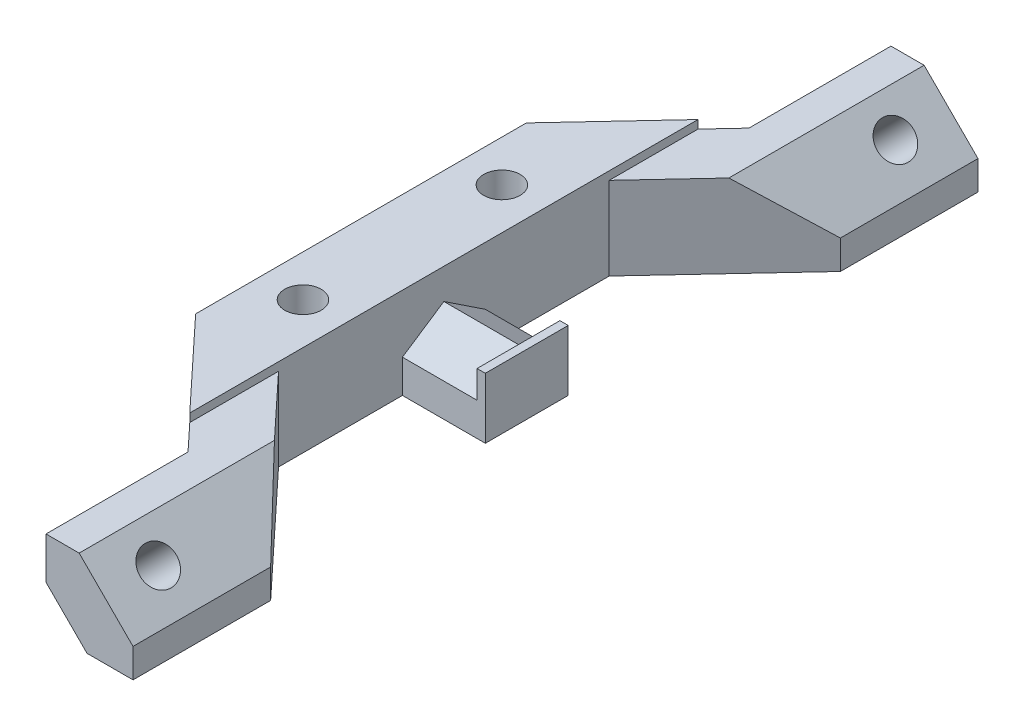
ISO-10303-21;
HEADER;
FILE_DESCRIPTION(('STEP AP214'),'2;1');
FILE_NAME('part.step','',(''),(''),'','','');
FILE_SCHEMA(('AUTOMOTIVE_DESIGN { 1 0 10303 214 1 1 1 1 }'));
ENDSEC;
DATA;
#1=APPLICATION_CONTEXT('core data for automotive mechanical design processes');
#2=APPLICATION_PROTOCOL_DEFINITION('international standard','automotive_design',2000,#1);
#3=PRODUCT_CONTEXT('',#1,'mechanical');
#4=PRODUCT('Part','Part','',(#3));
#5=PRODUCT_RELATED_PRODUCT_CATEGORY('part','',(#4));
#6=PRODUCT_DEFINITION_FORMATION('','',#4);
#7=PRODUCT_DEFINITION_CONTEXT('part definition',#1,'design');
#8=PRODUCT_DEFINITION('design','',#6,#7);
#9=PRODUCT_DEFINITION_SHAPE('','',#8);
#10=(LENGTH_UNIT() NAMED_UNIT(*) SI_UNIT(.MILLI.,.METRE.));
#11=(NAMED_UNIT(*) PLANE_ANGLE_UNIT() SI_UNIT($,.RADIAN.));
#12=(NAMED_UNIT(*) SI_UNIT($,.STERADIAN.) SOLID_ANGLE_UNIT());
#13=UNCERTAINTY_MEASURE_WITH_UNIT(LENGTH_MEASURE(1.E-05),#10,'distance_accuracy_value','');
#14=(GEOMETRIC_REPRESENTATION_CONTEXT(3) GLOBAL_UNCERTAINTY_ASSIGNED_CONTEXT((#13)) GLOBAL_UNIT_ASSIGNED_CONTEXT((#10,
#11,#12)) REPRESENTATION_CONTEXT('',''));
#15=CARTESIAN_POINT('',(0.,0.,0.));
#16=DIRECTION('',(0.,0.,1.));
#17=DIRECTION('',(1.,0.,0.));
#18=AXIS2_PLACEMENT_3D('',#15,#16,#17);
#19=CARTESIAN_POINT('',(-18.6319731957759,10.,5.35370027381823));
#20=DIRECTION('',(0.,-1.,0.));
#21=DIRECTION('',(0.,0.,-1.));
#22=AXIS2_PLACEMENT_3D('',#19,#20,#21);
#23=PLANE('',#22);
#24=DIRECTION('',(0.,0.,-1.));
#25=VECTOR('',#24,1.);
#26=CARTESIAN_POINT('',(5.,10.,30.6574005476366));
#27=LINE('',#26,#25);
#28=CARTESIAN_POINT('',(5.,10.,30.6574005476366));
#29=VERTEX_POINT('',#28);
#30=CARTESIAN_POINT('',(5.,10.,19.95));
#31=VERTEX_POINT('',#30);
#32=EDGE_CURVE('E50',#29,#31,#27,.T.);
#33=ORIENTED_EDGE('',*,*,#32,.F.);
#34=DIRECTION('',(0.682552631578946,0.,0.730836442115919));
#35=VECTOR('',#34,1.);
#36=CARTESIAN_POINT('',(-5.,10.,19.95));
#37=LINE('',#36,#35);
#38=CARTESIAN_POINT('',(7.9685,10.,33.8358924002025));
#39=VERTEX_POINT('',#38);
#40=EDGE_CURVE('E237',#29,#39,#37,.T.);
#41=ORIENTED_EDGE('',*,*,#40,.T.);
#42=DIRECTION('',(0.,0.,1.));
#43=VECTOR('',#42,1.);
#44=CARTESIAN_POINT('',(7.9685,10.,50.9712624275843));
#45=LINE('',#44,#43);
#46=CARTESIAN_POINT('',(7.9685,10.,50.9712624275843));
#47=VERTEX_POINT('',#46);
#48=EDGE_CURVE('E468',#39,#47,#45,.T.);
#49=ORIENTED_EDGE('',*,*,#48,.T.);
#50=DIRECTION('',(1.,0.,0.));
#51=VECTOR('',#50,1.);
#52=CARTESIAN_POINT('',(18.4685,10.,50.9712624275843));
#53=LINE('',#52,#51);
#54=CARTESIAN_POINT('',(11.9685,10.,50.9712624275843));
#55=VERTEX_POINT('',#54);
#56=EDGE_CURVE('E255',#47,#55,#53,.T.);
#57=ORIENTED_EDGE('',*,*,#56,.T.);
#58=DIRECTION('',(0.,0.,1.));
#59=VECTOR('',#58,1.);
#60=CARTESIAN_POINT('',(11.9685,10.,5.35370027381824));
#61=LINE('',#60,#59);
#62=CARTESIAN_POINT('',(11.9685,10.,27.4114520716205));
#63=VERTEX_POINT('',#62);
#64=EDGE_CURVE('E42',#63,#55,#61,.T.);
#65=ORIENTED_EDGE('',*,*,#64,.F.);
#66=DIRECTION('',(-0.682552631578947,0.,-0.730836442115919));
#67=VECTOR('',#66,1.);
#68=CARTESIAN_POINT('',(5.,10.,19.95));
#69=LINE('',#68,#67);
#70=EDGE_CURVE('E253',#63,#31,#69,.T.);
#71=ORIENTED_EDGE('',*,*,#70,.T.);
#72=EDGE_LOOP('',(#33,#41,#49,#57,#65,#71));
#73=FACE_BOUND('',#72,.T.);
#74=ADVANCED_FACE('F33',(#73),#23,.F.);
#75=CARTESIAN_POINT('',(5.,10.,-19.95));
#76=VERTEX_POINT('',#75);
#77=CARTESIAN_POINT('',(5.,10.,-30.6574005476366));
#78=VERTEX_POINT('',#77);
#79=EDGE_CURVE('E11',#76,#78,#27,.T.);
#80=ORIENTED_EDGE('',*,*,#79,.F.);
#81=DIRECTION('',(0.682552631578948,0.,-0.730836442115918));
#82=VECTOR('',#81,1.);
#83=CARTESIAN_POINT('',(5.,10.,-19.95));
#84=LINE('',#83,#82);
#85=CARTESIAN_POINT('',(11.9685,10.,-27.4114520716205));
#86=VERTEX_POINT('',#85);
#87=EDGE_CURVE('E258',#76,#86,#84,.T.);
#88=ORIENTED_EDGE('',*,*,#87,.T.);
#89=DIRECTION('',(0.,0.,1.));
#90=VECTOR('',#89,1.);
#91=CARTESIAN_POINT('',(11.9685,10.,-50.9712624275843));
#92=LINE('',#91,#90);
#93=CARTESIAN_POINT('',(11.9685,10.,-50.9712624275843));
#94=VERTEX_POINT('',#93);
#95=EDGE_CURVE('E387',#94,#86,#92,.T.);
#96=ORIENTED_EDGE('',*,*,#95,.F.);
#97=DIRECTION('',(-1.,0.,0.));
#98=VECTOR('',#97,1.);
#99=CARTESIAN_POINT('',(18.4685,10.,-50.9712624275843));
#100=LINE('',#99,#98);
#101=CARTESIAN_POINT('',(7.9685,10.,-50.9712624275843));
#102=VERTEX_POINT('',#101);
#103=EDGE_CURVE('E261',#94,#102,#100,.T.);
#104=ORIENTED_EDGE('',*,*,#103,.T.);
#105=DIRECTION('',(0.,0.,1.));
#106=VECTOR('',#105,1.);
#107=CARTESIAN_POINT('',(7.9685,10.,-50.9712624275843));
#108=LINE('',#107,#106);
#109=CARTESIAN_POINT('',(7.9685,10.,-33.8358924002025));
#110=VERTEX_POINT('',#109);
#111=EDGE_CURVE('E398',#102,#110,#108,.T.);
#112=ORIENTED_EDGE('',*,*,#111,.T.);
#113=DIRECTION('',(-0.682552631578947,0.,0.730836442115918));
#114=VECTOR('',#113,1.);
#115=CARTESIAN_POINT('',(-5.,10.,-19.95));
#116=LINE('',#115,#114);
#117=EDGE_CURVE('E400',#110,#78,#116,.T.);
#118=ORIENTED_EDGE('',*,*,#117,.T.);
#119=EDGE_LOOP('',(#80,#88,#96,#104,#112,#118));
#120=FACE_BOUND('',#119,.T.);
#121=ADVANCED_FACE('F535',(#120),#23,.F.);
#122=CARTESIAN_POINT('',(0.,0.,-12.));
#123=DIRECTION('',(0.,1.,0.));
#124=DIRECTION('',(0.,0.,1.));
#125=AXIS2_PLACEMENT_3D('',#122,#123,#124);
#126=CYLINDRICAL_SURFACE('',#125,2.2);
#127=CARTESIAN_POINT('',(0.,4.,-12.));
#128=DIRECTION('',(0.,-1.,0.));
#129=DIRECTION('',(0.,0.,-1.));
#130=AXIS2_PLACEMENT_3D('',#127,#128,#129);
#131=CIRCLE('',#130,2.2);
#132=CARTESIAN_POINT('',(0.,4.,-14.2));
#133=VERTEX_POINT('',#132);
#134=EDGE_CURVE('E280',#133,#133,#131,.F.);
#135=ORIENTED_EDGE('',*,*,#134,.F.);
#136=EDGE_LOOP('',(#135));
#137=FACE_BOUND('',#136,.T.);
#138=CARTESIAN_POINT('',(0.,11.,-12.));
#139=DIRECTION('',(0.,1.,0.));
#140=DIRECTION('',(0.,0.,1.));
#141=AXIS2_PLACEMENT_3D('',#138,#139,#140);
#142=CIRCLE('',#141,2.2);
#143=CARTESIAN_POINT('',(0.,11.,-9.8));
#144=VERTEX_POINT('',#143);
#145=EDGE_CURVE('E543',#144,#144,#142,.T.);
#146=ORIENTED_EDGE('',*,*,#145,.T.);
#147=EDGE_LOOP('',(#146));
#148=FACE_BOUND('',#147,.T.);
#149=ADVANCED_FACE('F547',(#137,#148),#126,.F.);
#150=CARTESIAN_POINT('',(0.,0.,12.));
#151=DIRECTION('',(0.,1.,0.));
#152=DIRECTION('',(0.,0.,1.));
#153=AXIS2_PLACEMENT_3D('',#150,#151,#152);
#154=CYLINDRICAL_SURFACE('',#153,2.2);
#155=CARTESIAN_POINT('',(0.,4.,12.));
#156=DIRECTION('',(0.,-1.,0.));
#157=DIRECTION('',(0.,0.,-1.));
#158=AXIS2_PLACEMENT_3D('',#155,#156,#157);
#159=CIRCLE('',#158,2.2);
#160=CARTESIAN_POINT('',(0.,4.,9.8));
#161=VERTEX_POINT('',#160);
#162=EDGE_CURVE('E285',#161,#161,#159,.F.);
#163=ORIENTED_EDGE('',*,*,#162,.F.);
#164=EDGE_LOOP('',(#163));
#165=FACE_BOUND('',#164,.T.);
#166=CARTESIAN_POINT('',(0.,11.,12.));
#167=DIRECTION('',(0.,1.,0.));
#168=DIRECTION('',(0.,0.,1.));
#169=AXIS2_PLACEMENT_3D('',#166,#167,#168);
#170=CIRCLE('',#169,2.2);
#171=CARTESIAN_POINT('',(0.,11.,14.2));
#172=VERTEX_POINT('',#171);
#173=EDGE_CURVE('E278',#172,#172,#170,.T.);
#174=ORIENTED_EDGE('',*,*,#173,.T.);
#175=EDGE_LOOP('',(#174));
#176=FACE_BOUND('',#175,.T.);
#177=ADVANCED_FACE('F575',(#165,#176),#154,.F.);
#178=CARTESIAN_POINT('',(5.,10.,19.95));
#179=DIRECTION('',(-1.,0.,0.));
#180=DIRECTION('',(0.,0.,1.));
#181=AXIS2_PLACEMENT_3D('',#178,#179,#180);
#182=PLANE('',#181);
#183=DIRECTION('',(0.,-1.,0.));
#184=VECTOR('',#183,1.);
#185=CARTESIAN_POINT('',(5.,4.,5.));
#186=LINE('',#185,#184);
#187=CARTESIAN_POINT('',(5.,4.,5.));
#188=VERTEX_POINT('',#187);
#189=CARTESIAN_POINT('',(5.,0.,5.));
#190=VERTEX_POINT('',#189);
#191=EDGE_CURVE('E58',#188,#190,#186,.T.);
#192=ORIENTED_EDGE('',*,*,#191,.F.);
#193=DIRECTION('',(0.,-0.552770798392567,0.833333333333333));
#194=VECTOR('',#193,1.);
#195=CARTESIAN_POINT('',(5.,7.3166247903554,0.));
#196=LINE('',#195,#194);
#197=CARTESIAN_POINT('',(5.,7.3166247903554,0.));
#198=VERTEX_POINT('',#197);
#199=EDGE_CURVE('E325',#198,#188,#196,.T.);
#200=ORIENTED_EDGE('',*,*,#199,.F.);
#201=DIRECTION('',(0.,0.552770798392567,0.833333333333333));
#202=VECTOR('',#201,1.);
#203=CARTESIAN_POINT('',(5.,7.3166247903554,0.));
#204=LINE('',#203,#202);
#205=CARTESIAN_POINT('',(5.,4.,-5.));
#206=VERTEX_POINT('',#205);
#207=EDGE_CURVE('E314',#206,#198,#204,.T.);
#208=ORIENTED_EDGE('',*,*,#207,.F.);
#209=DIRECTION('',(0.,1.,0.));
#210=VECTOR('',#209,1.);
#211=CARTESIAN_POINT('',(5.,4.,-5.));
#212=LINE('',#211,#210);
#213=CARTESIAN_POINT('',(5.,0.,-5.00000000000003));
#214=VERTEX_POINT('',#213);
#215=EDGE_CURVE('E319',#214,#206,#212,.T.);
#216=ORIENTED_EDGE('',*,*,#215,.F.);
#217=DIRECTION('',(0.,0.,-1.));
#218=VECTOR('',#217,1.);
#219=CARTESIAN_POINT('',(5.,0.,19.95));
#220=LINE('',#219,#218);
#221=CARTESIAN_POINT('',(5.,0.,-19.95));
#222=VERTEX_POINT('',#221);
#223=EDGE_CURVE('E440',#214,#222,#220,.T.);
#224=ORIENTED_EDGE('',*,*,#223,.T.);
#225=DIRECTION('',(0.,-1.,0.));
#226=VECTOR('',#225,1.);
#227=CARTESIAN_POINT('',(5.,10.,-19.95));
#228=LINE('',#227,#226);
#229=EDGE_CURVE('E250',#76,#222,#228,.T.);
#230=ORIENTED_EDGE('',*,*,#229,.F.);
#231=ORIENTED_EDGE('',*,*,#79,.T.);
#232=DIRECTION('',(0.,-1.,0.));
#233=VECTOR('',#232,1.);
#234=CARTESIAN_POINT('',(5.,11.,-30.6574005476366));
#235=LINE('',#234,#233);
#236=CARTESIAN_POINT('',(5.,11.,-30.6574005476366));
#237=VERTEX_POINT('',#236);
#238=EDGE_CURVE('E219',#237,#78,#235,.T.);
#239=ORIENTED_EDGE('',*,*,#238,.F.);
#240=DIRECTION('',(0.,0.,-1.));
#241=VECTOR('',#240,1.);
#242=CARTESIAN_POINT('',(5.,11.,30.6574005476366));
#243=LINE('',#242,#241);
#244=CARTESIAN_POINT('',(5.,11.,30.6574005476366));
#245=VERTEX_POINT('',#244);
#246=EDGE_CURVE('E213',#245,#237,#243,.T.);
#247=ORIENTED_EDGE('',*,*,#246,.F.);
#248=DIRECTION('',(0.,-1.,0.));
#249=VECTOR('',#248,1.);
#250=CARTESIAN_POINT('',(5.,11.,30.6574005476366));
#251=LINE('',#250,#249);
#252=EDGE_CURVE('E217',#245,#29,#251,.T.);
#253=ORIENTED_EDGE('',*,*,#252,.T.);
#254=ORIENTED_EDGE('',*,*,#32,.T.);
#255=DIRECTION('',(0.,-1.,0.));
#256=VECTOR('',#255,1.);
#257=CARTESIAN_POINT('',(5.,10.,19.95));
#258=LINE('',#257,#256);
#259=CARTESIAN_POINT('',(5.,0.,19.95));
#260=VERTEX_POINT('',#259);
#261=EDGE_CURVE('E246',#31,#260,#258,.T.);
#262=ORIENTED_EDGE('',*,*,#261,.T.);
#263=EDGE_CURVE('E262',#260,#190,#220,.T.);
#264=ORIENTED_EDGE('',*,*,#263,.T.);
#265=EDGE_LOOP('',(#192,#200,#208,#216,#224,#230,#231,#239,#247,#253,#254,#262,#264));
#266=FACE_BOUND('',#265,.T.);
#267=ADVANCED_FACE('F215',(#266),#182,.F.);
#268=CARTESIAN_POINT('',(5.,10.,-19.95));
#269=DIRECTION('',(-0.730836442115918,0.,-0.682552631578948));
#270=DIRECTION('',(-0.682552631578948,0.,0.730836442115918));
#271=AXIS2_PLACEMENT_3D('',#268,#269,#270);
#272=PLANE('',#271);
#273=DIRECTION('',(0.563750860619244,-0.563750860619242,-0.603630627372507));
#274=VECTOR('',#273,1.);
#275=CARTESIAN_POINT('',(7.2146940564078,14.7538059435922,-22.3213616352428));
#276=LINE('',#275,#274);
#277=CARTESIAN_POINT('',(18.4685,3.5,-34.3712624275843));
#278=VERTEX_POINT('',#277);
#279=EDGE_CURVE('E394',#86,#278,#276,.T.);
#280=ORIENTED_EDGE('',*,*,#279,.F.);
#281=ORIENTED_EDGE('',*,*,#87,.F.);
#282=ORIENTED_EDGE('',*,*,#229,.T.);
#283=DIRECTION('',(0.682552631578948,0.,-0.730836442115918));
#284=VECTOR('',#283,1.);
#285=CARTESIAN_POINT('',(5.,0.,-19.95));
#286=LINE('',#285,#284);
#287=CARTESIAN_POINT('',(18.4685,0.,-34.3712624275843));
#288=VERTEX_POINT('',#287);
#289=EDGE_CURVE('E396',#222,#288,#286,.T.);
#290=ORIENTED_EDGE('',*,*,#289,.T.);
#291=DIRECTION('',(0.,-1.,0.));
#292=VECTOR('',#291,1.);
#293=CARTESIAN_POINT('',(18.4685,10.,-34.3712624275843));
#294=LINE('',#293,#292);
#295=EDGE_CURVE('E414',#278,#288,#294,.T.);
#296=ORIENTED_EDGE('',*,*,#295,.F.);
#297=EDGE_LOOP('',(#280,#281,#282,#290,#296));
#298=FACE_BOUND('',#297,.T.);
#299=ADVANCED_FACE('F35',(#298),#272,.F.);
#300=CARTESIAN_POINT('',(18.4685,10.,-34.3712624275843));
#301=DIRECTION('',(-1.,0.,0.));
#302=DIRECTION('',(0.,0.,1.));
#303=AXIS2_PLACEMENT_3D('',#300,#301,#302);
#304=PLANE('',#303);
#305=DIRECTION('',(0.,0.,1.));
#306=VECTOR('',#305,1.);
#307=CARTESIAN_POINT('',(18.4685,3.5,-50.9712624275843));
#308=LINE('',#307,#306);
#309=CARTESIAN_POINT('',(18.4685,3.5,-50.9712624275843));
#310=VERTEX_POINT('',#309);
#311=EDGE_CURVE('E390',#310,#278,#308,.T.);
#312=ORIENTED_EDGE('',*,*,#311,.T.);
#313=ORIENTED_EDGE('',*,*,#295,.T.);
#314=DIRECTION('',(0.,0.,-1.));
#315=VECTOR('',#314,1.);
#316=CARTESIAN_POINT('',(18.4685,0.,-34.3712624275843));
#317=LINE('',#316,#315);
#318=CARTESIAN_POINT('',(18.4685,0.,-50.9712624275843));
#319=VERTEX_POINT('',#318);
#320=EDGE_CURVE('E462',#288,#319,#317,.T.);
#321=ORIENTED_EDGE('',*,*,#320,.T.);
#322=DIRECTION('',(0.,-1.,0.));
#323=VECTOR('',#322,1.);
#324=CARTESIAN_POINT('',(18.4685,10.,-50.9712624275843));
#325=LINE('',#324,#323);
#326=EDGE_CURVE('E416',#310,#319,#325,.T.);
#327=ORIENTED_EDGE('',*,*,#326,.F.);
#328=EDGE_LOOP('',(#312,#313,#321,#327));
#329=FACE_BOUND('',#328,.T.);
#330=ADVANCED_FACE('F531',(#329),#304,.F.);
#331=CARTESIAN_POINT('',(18.4685,10.,-50.9712624275843));
#332=DIRECTION('',(0.,0.,1.));
#333=DIRECTION('',(1.,0.,0.));
#334=AXIS2_PLACEMENT_3D('',#331,#332,#333);
#335=PLANE('',#334);
#336=DIRECTION('',(-1.,0.,0.));
#337=VECTOR('',#336,1.);
#338=CARTESIAN_POINT('',(18.4685,0.,-50.9712624275843));
#339=LINE('',#338,#337);
#340=CARTESIAN_POINT('',(12.9182474683059,0.,-50.9712624275843));
#341=VERTEX_POINT('',#340);
#342=EDGE_CURVE('E459',#319,#341,#339,.T.);
#343=ORIENTED_EDGE('',*,*,#342,.T.);
#344=DIRECTION('',(0.703526470681453,-0.710669054518697,0.));
#345=VECTOR('',#344,1.);
#346=CARTESIAN_POINT('',(7.9685,5.,-50.9712624275843));
#347=LINE('',#346,#345);
#348=CARTESIAN_POINT('',(7.9685,5.,-50.9712624275843));
#349=VERTEX_POINT('',#348);
#350=EDGE_CURVE('E344',#349,#341,#347,.T.);
#351=ORIENTED_EDGE('',*,*,#350,.F.);
#352=DIRECTION('',(0.,-1.,0.));
#353=VECTOR('',#352,1.);
#354=CARTESIAN_POINT('',(7.9685,10.,-50.9712624275843));
#355=LINE('',#354,#353);
#356=EDGE_CURVE('E418',#102,#349,#355,.T.);
#357=ORIENTED_EDGE('',*,*,#356,.F.);
#358=ORIENTED_EDGE('',*,*,#103,.F.);
#359=DIRECTION('',(-0.707106781186549,0.707106781186546,0.));
#360=VECTOR('',#359,1.);
#361=CARTESIAN_POINT('',(10.98425,10.98425,-50.9712624275843));
#362=LINE('',#361,#360);
#363=EDGE_CURVE('E382',#310,#94,#362,.T.);
#364=ORIENTED_EDGE('',*,*,#363,.F.);
#365=ORIENTED_EDGE('',*,*,#326,.T.);
#366=EDGE_LOOP('',(#343,#351,#357,#358,#364,#365));
#367=FACE_BOUND('',#366,.T.);
#368=ADVANCED_FACE('F585',(#367),#335,.F.);
#369=CARTESIAN_POINT('',(18.4685,10.,50.9712624275843));
#370=DIRECTION('',(0.,0.,-1.));
#371=DIRECTION('',(-1.,0.,0.));
#372=AXIS2_PLACEMENT_3D('',#369,#370,#371);
#373=PLANE('',#372);
#374=DIRECTION('',(0.,-1.,0.));
#375=VECTOR('',#374,1.);
#376=CARTESIAN_POINT('',(7.9685,10.,50.9712624275843));
#377=LINE('',#376,#375);
#378=CARTESIAN_POINT('',(7.9685,4.94974746830583,50.9712624275843));
#379=VERTEX_POINT('',#378);
#380=EDGE_CURVE('E432',#47,#379,#377,.T.);
#381=ORIENTED_EDGE('',*,*,#380,.T.);
#382=DIRECTION('',(-0.707106781186548,0.707106781186547,0.));
#383=VECTOR('',#382,1.);
#384=CARTESIAN_POINT('',(7.9685,4.94974746830583,50.9712624275843));
#385=LINE('',#384,#383);
#386=CARTESIAN_POINT('',(12.9182474683058,0.,50.9712624275843));
#387=VERTEX_POINT('',#386);
#388=EDGE_CURVE('E363',#387,#379,#385,.T.);
#389=ORIENTED_EDGE('',*,*,#388,.F.);
#390=DIRECTION('',(1.,0.,0.));
#391=VECTOR('',#390,1.);
#392=CARTESIAN_POINT('',(18.4685,0.,50.9712624275843));
#393=LINE('',#392,#391);
#394=CARTESIAN_POINT('',(18.4685,0.,50.9712624275843));
#395=VERTEX_POINT('',#394);
#396=EDGE_CURVE('E446',#387,#395,#393,.T.);
#397=ORIENTED_EDGE('',*,*,#396,.T.);
#398=DIRECTION('',(0.,-1.,0.));
#399=VECTOR('',#398,1.);
#400=CARTESIAN_POINT('',(18.4685,10.,50.9712624275843));
#401=LINE('',#400,#399);
#402=CARTESIAN_POINT('',(18.4685,3.5,50.9712624275843));
#403=VERTEX_POINT('',#402);
#404=EDGE_CURVE('E435',#403,#395,#401,.T.);
#405=ORIENTED_EDGE('',*,*,#404,.F.);
#406=DIRECTION('',(-0.707106781186549,0.707106781186546,0.));
#407=VECTOR('',#406,1.);
#408=CARTESIAN_POINT('',(10.98425,10.98425,50.9712624275843));
#409=LINE('',#408,#407);
#410=EDGE_CURVE('E381',#403,#55,#409,.T.);
#411=ORIENTED_EDGE('',*,*,#410,.T.);
#412=ORIENTED_EDGE('',*,*,#56,.F.);
#413=EDGE_LOOP('',(#381,#389,#397,#405,#411,#412));
#414=FACE_BOUND('',#413,.T.);
#415=ADVANCED_FACE('F479',(#414),#373,.F.);
#416=CARTESIAN_POINT('',(18.4685,10.,34.3712624275843));
#417=DIRECTION('',(-1.,0.,0.));
#418=DIRECTION('',(0.,0.,1.));
#419=AXIS2_PLACEMENT_3D('',#416,#417,#418);
#420=PLANE('',#419);
#421=CARTESIAN_POINT('',(18.4685,3.5,34.3712624275842));
#422=VERTEX_POINT('',#421);
#423=EDGE_CURVE('E384',#422,#403,#308,.T.);
#424=ORIENTED_EDGE('',*,*,#423,.T.);
#425=ORIENTED_EDGE('',*,*,#404,.T.);
#426=DIRECTION('',(0.,0.,-1.));
#427=VECTOR('',#426,1.);
#428=CARTESIAN_POINT('',(18.4685,0.,34.3712624275843));
#429=LINE('',#428,#427);
#430=CARTESIAN_POINT('',(18.4685,0.,34.3712624275843));
#431=VERTEX_POINT('',#430);
#432=EDGE_CURVE('E443',#395,#431,#429,.T.);
#433=ORIENTED_EDGE('',*,*,#432,.T.);
#434=DIRECTION('',(0.,-1.,0.));
#435=VECTOR('',#434,1.);
#436=CARTESIAN_POINT('',(18.4685,10.,34.3712624275843));
#437=LINE('',#436,#435);
#438=EDGE_CURVE('E249',#422,#431,#437,.T.);
#439=ORIENTED_EDGE('',*,*,#438,.F.);
#440=EDGE_LOOP('',(#424,#425,#433,#439));
#441=FACE_BOUND('',#440,.T.);
#442=ADVANCED_FACE('F579',(#441),#420,.F.);
#443=CARTESIAN_POINT('',(5.,10.,19.95));
#444=DIRECTION('',(-0.730836442115919,0.,0.682552631578947));
#445=DIRECTION('',(0.682552631578947,0.,0.730836442115919));
#446=AXIS2_PLACEMENT_3D('',#443,#444,#445);
#447=PLANE('',#446);
#448=DIRECTION('',(-0.563750860619244,0.563750860619241,-0.603630627372507));
#449=VECTOR('',#448,1.);
#450=CARTESIAN_POINT('',(7.2146940564078,14.7538059435922,22.3213616352428));
#451=LINE('',#450,#449);
#452=EDGE_CURVE('E389',#422,#63,#451,.T.);
#453=ORIENTED_EDGE('',*,*,#452,.F.);
#454=ORIENTED_EDGE('',*,*,#438,.T.);
#455=DIRECTION('',(-0.682552631578947,0.,-0.730836442115919));
#456=VECTOR('',#455,1.);
#457=CARTESIAN_POINT('',(5.,0.,19.95));
#458=LINE('',#457,#456);
#459=EDGE_CURVE('E441',#431,#260,#458,.T.);
#460=ORIENTED_EDGE('',*,*,#459,.T.);
#461=ORIENTED_EDGE('',*,*,#261,.F.);
#462=ORIENTED_EDGE('',*,*,#70,.F.);
#463=EDGE_LOOP('',(#453,#454,#460,#461,#462));
#464=FACE_BOUND('',#463,.T.);
#465=ADVANCED_FACE('F487',(#464),#447,.F.);
#466=CARTESIAN_POINT('',(7.9685,10.,-50.9712624275843));
#467=DIRECTION('',(1.,0.,0.));
#468=DIRECTION('',(0.,0.,-1.));
#469=AXIS2_PLACEMENT_3D('',#466,#467,#468);
#470=PLANE('',#469);
#471=ORIENTED_EDGE('',*,*,#356,.T.);
#472=DIRECTION('',(0.,0.,-1.));
#473=VECTOR('',#472,1.);
#474=CARTESIAN_POINT('',(7.96849999999999,5.,-35.9712624275843));
#475=LINE('',#474,#473);
#476=CARTESIAN_POINT('',(7.96849999999999,5.,-35.9712624275843));
#477=VERTEX_POINT('',#476);
#478=EDGE_CURVE('E354',#477,#349,#475,.T.);
#479=ORIENTED_EDGE('',*,*,#478,.F.);
#480=DIRECTION('',(0.,1.,0.));
#481=VECTOR('',#480,1.);
#482=CARTESIAN_POINT('',(7.96849999999999,5.,-35.9712624275843));
#483=LINE('',#482,#481);
#484=CARTESIAN_POINT('',(7.9685,0.,-35.9712624275843));
#485=VERTEX_POINT('',#484);
#486=EDGE_CURVE('E349',#485,#477,#483,.T.);
#487=ORIENTED_EDGE('',*,*,#486,.F.);
#488=DIRECTION('',(0.,0.,1.));
#489=VECTOR('',#488,1.);
#490=CARTESIAN_POINT('',(7.9685,0.,-50.9712624275843));
#491=LINE('',#490,#489);
#492=CARTESIAN_POINT('',(7.9685,0.,-33.8358924002025));
#493=VERTEX_POINT('',#492);
#494=EDGE_CURVE('E457',#485,#493,#491,.T.);
#495=ORIENTED_EDGE('',*,*,#494,.T.);
#496=DIRECTION('',(0.,-1.,0.));
#497=VECTOR('',#496,1.);
#498=CARTESIAN_POINT('',(7.9685,10.,-33.8358924002025));
#499=LINE('',#498,#497);
#500=EDGE_CURVE('E421',#110,#493,#499,.T.);
#501=ORIENTED_EDGE('',*,*,#500,.F.);
#502=ORIENTED_EDGE('',*,*,#111,.F.);
#503=EDGE_LOOP('',(#471,#479,#487,#495,#501,#502));
#504=FACE_BOUND('',#503,.T.);
#505=ADVANCED_FACE('F578',(#504),#470,.F.);
#506=CARTESIAN_POINT('',(-5.,10.,-19.95));
#507=DIRECTION('',(0.730836442115918,0.,0.682552631578947));
#508=DIRECTION('',(0.682552631578947,0.,-0.730836442115918));
#509=AXIS2_PLACEMENT_3D('',#506,#507,#508);
#510=PLANE('',#509);
#511=DIRECTION('',(-0.682552631578947,0.,0.730836442115918));
#512=VECTOR('',#511,1.);
#513=CARTESIAN_POINT('',(-5.,0.,-19.95));
#514=LINE('',#513,#512);
#515=CARTESIAN_POINT('',(-5.,0.,-19.95));
#516=VERTEX_POINT('',#515);
#517=EDGE_CURVE('E455',#493,#516,#514,.T.);
#518=ORIENTED_EDGE('',*,*,#517,.T.);
#519=DIRECTION('',(0.,-1.,0.));
#520=VECTOR('',#519,1.);
#521=CARTESIAN_POINT('',(-5.,10.,-19.95));
#522=LINE('',#521,#520);
#523=CARTESIAN_POINT('',(-5.,11.,-19.95));
#524=VERTEX_POINT('',#523);
#525=EDGE_CURVE('E424',#524,#516,#522,.T.);
#526=ORIENTED_EDGE('',*,*,#525,.F.);
#527=DIRECTION('',(-0.682552631578947,0.,0.730836442115918));
#528=VECTOR('',#527,1.);
#529=CARTESIAN_POINT('',(5.,11.,-30.6574005476366));
#530=LINE('',#529,#528);
#531=EDGE_CURVE('E223',#237,#524,#530,.T.);
#532=ORIENTED_EDGE('',*,*,#531,.F.);
#533=ORIENTED_EDGE('',*,*,#238,.T.);
#534=ORIENTED_EDGE('',*,*,#117,.F.);
#535=ORIENTED_EDGE('',*,*,#500,.T.);
#536=EDGE_LOOP('',(#518,#526,#532,#533,#534,#535));
#537=FACE_BOUND('',#536,.T.);
#538=ADVANCED_FACE('F539',(#537),#510,.F.);
#539=CARTESIAN_POINT('',(-5.,10.,19.95));
#540=DIRECTION('',(1.,0.,0.));
#541=DIRECTION('',(0.,0.,-1.));
#542=AXIS2_PLACEMENT_3D('',#539,#540,#541);
#543=PLANE('',#542);
#544=DIRECTION('',(0.,0.,1.));
#545=VECTOR('',#544,1.);
#546=CARTESIAN_POINT('',(-5.,0.,19.95));
#547=LINE('',#546,#545);
#548=CARTESIAN_POINT('',(-5.,0.,19.95));
#549=VERTEX_POINT('',#548);
#550=EDGE_CURVE('E453',#516,#549,#547,.T.);
#551=ORIENTED_EDGE('',*,*,#550,.T.);
#552=DIRECTION('',(0.,-1.,0.));
#553=VECTOR('',#552,1.);
#554=CARTESIAN_POINT('',(-5.,10.,19.95));
#555=LINE('',#554,#553);
#556=CARTESIAN_POINT('',(-5.,11.,19.95));
#557=VERTEX_POINT('',#556);
#558=EDGE_CURVE('E427',#557,#549,#555,.T.);
#559=ORIENTED_EDGE('',*,*,#558,.F.);
#560=DIRECTION('',(0.,0.,1.));
#561=VECTOR('',#560,1.);
#562=CARTESIAN_POINT('',(-5.,11.,-19.95));
#563=LINE('',#562,#561);
#564=EDGE_CURVE('E231',#524,#557,#563,.T.);
#565=ORIENTED_EDGE('',*,*,#564,.F.);
#566=ORIENTED_EDGE('',*,*,#525,.T.);
#567=EDGE_LOOP('',(#551,#559,#565,#566));
#568=FACE_BOUND('',#567,.T.);
#569=ADVANCED_FACE('F590',(#568),#543,.F.);
#570=CARTESIAN_POINT('',(-5.,10.,19.95));
#571=DIRECTION('',(0.730836442115919,0.,-0.682552631578946));
#572=DIRECTION('',(-0.682552631578946,0.,-0.730836442115919));
#573=AXIS2_PLACEMENT_3D('',#570,#571,#572);
#574=PLANE('',#573);
#575=DIRECTION('',(0.682552631578946,0.,0.730836442115919));
#576=VECTOR('',#575,1.);
#577=CARTESIAN_POINT('',(-5.,0.,19.95));
#578=LINE('',#577,#576);
#579=CARTESIAN_POINT('',(7.9685,0.,33.8358924002025));
#580=VERTEX_POINT('',#579);
#581=EDGE_CURVE('E451',#549,#580,#578,.T.);
#582=ORIENTED_EDGE('',*,*,#581,.T.);
#583=DIRECTION('',(0.,-1.,0.));
#584=VECTOR('',#583,1.);
#585=CARTESIAN_POINT('',(7.9685,10.,33.8358924002025));
#586=LINE('',#585,#584);
#587=EDGE_CURVE('E429',#39,#580,#586,.T.);
#588=ORIENTED_EDGE('',*,*,#587,.F.);
#589=ORIENTED_EDGE('',*,*,#40,.F.);
#590=ORIENTED_EDGE('',*,*,#252,.F.);
#591=DIRECTION('',(0.682552631578946,0.,0.730836442115919));
#592=VECTOR('',#591,1.);
#593=CARTESIAN_POINT('',(-5.,11.,19.95));
#594=LINE('',#593,#592);
#595=EDGE_CURVE('E224',#557,#245,#594,.T.);
#596=ORIENTED_EDGE('',*,*,#595,.F.);
#597=ORIENTED_EDGE('',*,*,#558,.T.);
#598=EDGE_LOOP('',(#582,#588,#589,#590,#596,#597));
#599=FACE_BOUND('',#598,.T.);
#600=ADVANCED_FACE('F235',(#599),#574,.F.);
#601=CARTESIAN_POINT('',(7.9685,10.,50.9712624275843));
#602=DIRECTION('',(1.,0.,0.));
#603=DIRECTION('',(0.,0.,-1.));
#604=AXIS2_PLACEMENT_3D('',#601,#602,#603);
#605=PLANE('',#604);
#606=DIRECTION('',(0.,-1.,0.));
#607=VECTOR('',#606,1.);
#608=CARTESIAN_POINT('',(7.9685,4.94974746830583,35.9712624275843));
#609=LINE('',#608,#607);
#610=CARTESIAN_POINT('',(7.9685,4.94974746830583,35.9712624275843));
#611=VERTEX_POINT('',#610);
#612=CARTESIAN_POINT('',(7.9685,0.,35.9712624275843));
#613=VERTEX_POINT('',#612);
#614=EDGE_CURVE('E362',#611,#613,#609,.T.);
#615=ORIENTED_EDGE('',*,*,#614,.F.);
#616=DIRECTION('',(0.,0.,1.));
#617=VECTOR('',#616,1.);
#618=CARTESIAN_POINT('',(7.9685,4.94974746830583,35.9712624275843));
#619=LINE('',#618,#617);
#620=EDGE_CURVE('E368',#611,#379,#619,.T.);
#621=ORIENTED_EDGE('',*,*,#620,.T.);
#622=ORIENTED_EDGE('',*,*,#380,.F.);
#623=ORIENTED_EDGE('',*,*,#48,.F.);
#624=ORIENTED_EDGE('',*,*,#587,.T.);
#625=DIRECTION('',(0.,0.,1.));
#626=VECTOR('',#625,1.);
#627=CARTESIAN_POINT('',(7.9685,0.,50.9712624275843));
#628=LINE('',#627,#626);
#629=EDGE_CURVE('E448',#580,#613,#628,.T.);
#630=ORIENTED_EDGE('',*,*,#629,.T.);
#631=EDGE_LOOP('',(#615,#621,#622,#623,#624,#630));
#632=FACE_BOUND('',#631,.T.);
#633=ADVANCED_FACE('F475',(#632),#605,.F.);
#634=CARTESIAN_POINT('',(-18.6319731957759,0.,5.35370027381823));
#635=DIRECTION('',(0.,-1.,0.));
#636=DIRECTION('',(0.,0.,-1.));
#637=AXIS2_PLACEMENT_3D('',#634,#635,#636);
#638=PLANE('',#637);
#639=CARTESIAN_POINT('',(0.,0.,-12.));
#640=DIRECTION('',(0.,-1.,0.));
#641=DIRECTION('',(0.,0.,-1.));
#642=AXIS2_PLACEMENT_3D('',#639,#640,#641);
#643=CIRCLE('',#642,3.5);
#644=CARTESIAN_POINT('',(0.,0.,-15.5));
#645=VERTEX_POINT('',#644);
#646=EDGE_CURVE('E238',#645,#645,#643,.T.);
#647=ORIENTED_EDGE('',*,*,#646,.F.);
#648=EDGE_LOOP('',(#647));
#649=FACE_BOUND('',#648,.T.);
#650=CARTESIAN_POINT('',(0.,0.,12.));
#651=DIRECTION('',(0.,-1.,0.));
#652=DIRECTION('',(0.,0.,-1.));
#653=AXIS2_PLACEMENT_3D('',#650,#651,#652);
#654=CIRCLE('',#653,3.5);
#655=CARTESIAN_POINT('',(0.,0.,8.5));
#656=VERTEX_POINT('',#655);
#657=EDGE_CURVE('E286',#656,#656,#654,.T.);
#658=ORIENTED_EDGE('',*,*,#657,.F.);
#659=EDGE_LOOP('',(#658));
#660=FACE_BOUND('',#659,.T.);
#661=DIRECTION('',(0.,0.,-1.));
#662=VECTOR('',#661,1.);
#663=CARTESIAN_POINT('',(12.9182474683059,0.,-35.9712624275843));
#664=LINE('',#663,#662);
#665=CARTESIAN_POINT('',(12.9182474683059,0.,-35.9712624275843));
#666=VERTEX_POINT('',#665);
#667=EDGE_CURVE('E352',#666,#341,#664,.T.);
#668=ORIENTED_EDGE('',*,*,#667,.T.);
#669=ORIENTED_EDGE('',*,*,#342,.F.);
#670=ORIENTED_EDGE('',*,*,#320,.F.);
#671=ORIENTED_EDGE('',*,*,#289,.F.);
#672=ORIENTED_EDGE('',*,*,#223,.F.);
#673=DIRECTION('',(-1.,0.,0.));
#674=VECTOR('',#673,1.);
#675=CARTESIAN_POINT('',(14.,0.,-5.00000000000003));
#676=LINE('',#675,#674);
#677=CARTESIAN_POINT('',(15.,0.,-5.00000000000003));
#678=VERTEX_POINT('',#677);
#679=EDGE_CURVE('E332',#678,#214,#676,.T.);
#680=ORIENTED_EDGE('',*,*,#679,.F.);
#681=DIRECTION('',(0.,0.,-1.));
#682=VECTOR('',#681,1.);
#683=CARTESIAN_POINT('',(15.,0.,5.));
#684=LINE('',#683,#682);
#685=CARTESIAN_POINT('',(15.,0.,5.));
#686=VERTEX_POINT('',#685);
#687=EDGE_CURVE('E292',#686,#678,#684,.T.);
#688=ORIENTED_EDGE('',*,*,#687,.F.);
#689=DIRECTION('',(-1.,0.,0.));
#690=VECTOR('',#689,1.);
#691=CARTESIAN_POINT('',(14.,0.,5.));
#692=LINE('',#691,#690);
#693=EDGE_CURVE('E335',#686,#190,#692,.T.);
#694=ORIENTED_EDGE('',*,*,#693,.T.);
#695=ORIENTED_EDGE('',*,*,#263,.F.);
#696=ORIENTED_EDGE('',*,*,#459,.F.);
#697=ORIENTED_EDGE('',*,*,#432,.F.);
#698=ORIENTED_EDGE('',*,*,#396,.F.);
#699=DIRECTION('',(0.,0.,1.));
#700=VECTOR('',#699,1.);
#701=CARTESIAN_POINT('',(12.9182474683058,0.,35.9712624275843));
#702=LINE('',#701,#700);
#703=CARTESIAN_POINT('',(12.9182474683058,0.,35.9712624275843));
#704=VERTEX_POINT('',#703);
#705=EDGE_CURVE('E370',#704,#387,#702,.T.);
#706=ORIENTED_EDGE('',*,*,#705,.F.);
#707=DIRECTION('',(1.,0.,0.));
#708=VECTOR('',#707,1.);
#709=CARTESIAN_POINT('',(7.9685,0.,35.9712624275843));
#710=LINE('',#709,#708);
#711=EDGE_CURVE('E365',#613,#704,#710,.T.);
#712=ORIENTED_EDGE('',*,*,#711,.F.);
#713=ORIENTED_EDGE('',*,*,#629,.F.);
#714=ORIENTED_EDGE('',*,*,#581,.F.);
#715=ORIENTED_EDGE('',*,*,#550,.F.);
#716=ORIENTED_EDGE('',*,*,#517,.F.);
#717=ORIENTED_EDGE('',*,*,#494,.F.);
#718=DIRECTION('',(-1.,0.,0.));
#719=VECTOR('',#718,1.);
#720=CARTESIAN_POINT('',(12.9182474683059,0.,-35.9712624275843));
#721=LINE('',#720,#719);
#722=EDGE_CURVE('E347',#666,#485,#721,.T.);
#723=ORIENTED_EDGE('',*,*,#722,.F.);
#724=EDGE_LOOP('',(#668,#669,#670,#671,#672,#680,#688,#694,#695,#696,#697,#698,#706,#712,#713,
#714,#715,#716,#717,#723));
#725=FACE_BOUND('',#724,.T.);
#726=ADVANCED_FACE('F492',(#649,#660,#725),#638,.T.);
#727=CARTESIAN_POINT('',(10.98425,10.98425,-50.9712624275843));
#728=DIRECTION('',(0.707106781186546,0.707106781186549,0.));
#729=DIRECTION('',(-0.707106781186549,0.707106781186546,0.));
#730=AXIS2_PLACEMENT_3D('',#727,#728,#729);
#731=PLANE('',#730);
#732=CARTESIAN_POINT('',(15.0043838789671,6.96411612103288,44.4712624275843));
#733=DIRECTION('',(0.707106781186546,0.707106781186549,0.));
#734=DIRECTION('',(0.707106781186549,-0.707106781186546,0.));
#735=AXIS2_PLACEMENT_3D('',#732,#733,#734);
#736=CIRCLE('',#735,2.2);
#737=CARTESIAN_POINT('',(16.5600187975775,5.40848120242248,44.4712624275843));
#738=VERTEX_POINT('',#737);
#739=EDGE_CURVE('E375',#738,#738,#736,.T.);
#740=ORIENTED_EDGE('',*,*,#739,.F.);
#741=EDGE_LOOP('',(#740));
#742=FACE_BOUND('',#741,.T.);
#743=ORIENTED_EDGE('',*,*,#452,.T.);
#744=ORIENTED_EDGE('',*,*,#64,.T.);
#745=ORIENTED_EDGE('',*,*,#410,.F.);
#746=ORIENTED_EDGE('',*,*,#423,.F.);
#747=EDGE_LOOP('',(#743,#744,#745,#746));
#748=FACE_BOUND('',#747,.T.);
#749=ADVANCED_FACE('F571',(#742,#748),#731,.T.);
#750=CARTESIAN_POINT('',(15.0043838789671,6.96411612103288,-44.4712624275843));
#751=DIRECTION('',(0.707106781186546,0.707106781186549,0.));
#752=DIRECTION('',(-0.707106781186549,0.707106781186546,0.));
#753=AXIS2_PLACEMENT_3D('',#750,#751,#752);
#754=CIRCLE('',#753,2.2);
#755=CARTESIAN_POINT('',(13.4487489603567,8.51975103964328,-44.4712624275843));
#756=VERTEX_POINT('',#755);
#757=EDGE_CURVE('E378',#756,#756,#754,.T.);
#758=ORIENTED_EDGE('',*,*,#757,.F.);
#759=EDGE_LOOP('',(#758));
#760=FACE_BOUND('',#759,.T.);
#761=ORIENTED_EDGE('',*,*,#279,.T.);
#762=ORIENTED_EDGE('',*,*,#311,.F.);
#763=ORIENTED_EDGE('',*,*,#363,.T.);
#764=ORIENTED_EDGE('',*,*,#95,.T.);
#765=EDGE_LOOP('',(#761,#762,#763,#764));
#766=FACE_BOUND('',#765,.T.);
#767=ADVANCED_FACE('F567',(#760,#766),#731,.T.);
#768=CARTESIAN_POINT('',(1.52013387896716,-6.52013387896713,-44.4712624275843));
#769=DIRECTION('',(0.707106781186546,0.707106781186549,0.));
#770=DIRECTION('',(-0.707106781186549,0.707106781186546,0.));
#771=AXIS2_PLACEMENT_3D('',#768,#769,#770);
#772=CYLINDRICAL_SURFACE('',#771,2.2);
#773=CARTESIAN_POINT('',(10.4915760579238,2.45130829998954,-44.4712624275843));
#774=DIRECTION('',(0.710669054518697,0.703526470681453,0.));
#775=DIRECTION('',(-0.703526470681453,0.710669054518697,0.));
#776=AXIS2_PLACEMENT_3D('',#773,#774,#775);
#777=ELLIPSE('',#776,2.20002805961394,2.2);
#778=CARTESIAN_POINT('',(8.94379808174343,4.01480016102999,-44.4712624275845));
#779=VERTEX_POINT('',#778);
#780=EDGE_CURVE('E356',#779,#779,#777,.F.);
#781=ORIENTED_EDGE('',*,*,#780,.T.);
#782=EDGE_LOOP('',(#781));
#783=FACE_BOUND('',#782,.T.);
#784=ORIENTED_EDGE('',*,*,#757,.T.);
#785=EDGE_LOOP('',(#784));
#786=FACE_BOUND('',#785,.T.);
#787=ADVANCED_FACE('F774',(#783,#786),#772,.F.);
#788=CARTESIAN_POINT('',(1.52013387896716,-6.52013387896713,44.4712624275843));
#789=DIRECTION('',(0.707106781186546,0.707106781186549,0.));
#790=DIRECTION('',(-0.707106781186549,0.707106781186546,0.));
#791=AXIS2_PLACEMENT_3D('',#788,#789,#790);
#792=CYLINDRICAL_SURFACE('',#791,2.2);
#793=CARTESIAN_POINT('',(10.47925761312,2.43898985518579,44.4712624275843));
#794=DIRECTION('',(0.707106781186547,0.707106781186548,0.));
#795=DIRECTION('',(-0.707106781186548,0.707106781186547,0.));
#796=AXIS2_PLACEMENT_3D('',#793,#794,#795);
#797=CIRCLE('',#796,2.2);
#798=CARTESIAN_POINT('',(8.92362269450963,3.99462477379619,44.4712624275843));
#799=VERTEX_POINT('',#798);
#800=EDGE_CURVE('E372',#799,#799,#797,.F.);
#801=ORIENTED_EDGE('',*,*,#800,.T.);
#802=EDGE_LOOP('',(#801));
#803=FACE_BOUND('',#802,.T.);
#804=ORIENTED_EDGE('',*,*,#739,.T.);
#805=EDGE_LOOP('',(#804));
#806=FACE_BOUND('',#805,.T.);
#807=ADVANCED_FACE('F779',(#803,#806),#792,.F.);
#808=CARTESIAN_POINT('',(7.9685,4.94974746830583,35.9712624275843));
#809=DIRECTION('',(0.707106781186547,0.707106781186548,0.));
#810=DIRECTION('',(-0.707106781186548,0.707106781186547,0.));
#811=AXIS2_PLACEMENT_3D('',#808,#809,#810);
#812=PLANE('',#811);
#813=ORIENTED_EDGE('',*,*,#388,.T.);
#814=ORIENTED_EDGE('',*,*,#620,.F.);
#815=DIRECTION('',(-0.707106781186548,0.707106781186547,0.));
#816=VECTOR('',#815,1.);
#817=CARTESIAN_POINT('',(7.9685,4.94974746830583,35.9712624275843));
#818=LINE('',#817,#816);
#819=EDGE_CURVE('E359',#704,#611,#818,.T.);
#820=ORIENTED_EDGE('',*,*,#819,.F.);
#821=ORIENTED_EDGE('',*,*,#705,.T.);
#822=EDGE_LOOP('',(#813,#814,#820,#821));
#823=FACE_BOUND('',#822,.T.);
#824=ORIENTED_EDGE('',*,*,#800,.F.);
#825=EDGE_LOOP('',(#824));
#826=FACE_BOUND('',#825,.T.);
#827=ADVANCED_FACE('F805',(#823,#826),#812,.F.);
#828=CARTESIAN_POINT('',(12.9182474683058,0.,35.9712624275843));
#829=DIRECTION('',(0.,0.,1.));
#830=DIRECTION('',(1.,0.,0.));
#831=AXIS2_PLACEMENT_3D('',#828,#829,#830);
#832=PLANE('',#831);
#833=ORIENTED_EDGE('',*,*,#819,.T.);
#834=ORIENTED_EDGE('',*,*,#614,.T.);
#835=ORIENTED_EDGE('',*,*,#711,.T.);
#836=EDGE_LOOP('',(#833,#834,#835));
#837=FACE_BOUND('',#836,.T.);
#838=ADVANCED_FACE('F766',(#837),#832,.T.);
#839=CARTESIAN_POINT('',(7.96849999999999,5.,-35.9712624275843));
#840=DIRECTION('',(0.710669054518697,0.703526470681453,0.));
#841=DIRECTION('',(-0.703526470681453,0.710669054518697,0.));
#842=AXIS2_PLACEMENT_3D('',#839,#840,#841);
#843=PLANE('',#842);
#844=ORIENTED_EDGE('',*,*,#350,.T.);
#845=ORIENTED_EDGE('',*,*,#667,.F.);
#846=DIRECTION('',(0.703526470681453,-0.710669054518697,0.));
#847=VECTOR('',#846,1.);
#848=CARTESIAN_POINT('',(7.96849999999999,5.,-35.9712624275843));
#849=LINE('',#848,#847);
#850=EDGE_CURVE('E345',#477,#666,#849,.T.);
#851=ORIENTED_EDGE('',*,*,#850,.F.);
#852=ORIENTED_EDGE('',*,*,#478,.T.);
#853=EDGE_LOOP('',(#844,#845,#851,#852));
#854=FACE_BOUND('',#853,.T.);
#855=ORIENTED_EDGE('',*,*,#780,.F.);
#856=EDGE_LOOP('',(#855));
#857=FACE_BOUND('',#856,.T.);
#858=ADVANCED_FACE('F755',(#854,#857),#843,.F.);
#859=CARTESIAN_POINT('',(12.9182474683059,0.,-35.9712624275843));
#860=DIRECTION('',(0.,0.,-1.));
#861=DIRECTION('',(-1.,0.,0.));
#862=AXIS2_PLACEMENT_3D('',#859,#860,#861);
#863=PLANE('',#862);
#864=ORIENTED_EDGE('',*,*,#850,.T.);
#865=ORIENTED_EDGE('',*,*,#722,.T.);
#866=ORIENTED_EDGE('',*,*,#486,.T.);
#867=EDGE_LOOP('',(#864,#865,#866));
#868=FACE_BOUND('',#867,.T.);
#869=ADVANCED_FACE('F746',(#868),#863,.T.);
#870=CARTESIAN_POINT('',(14.,7.3166247903554,0.));
#871=DIRECTION('',(0.,-0.833333333333333,0.552770798392567));
#872=DIRECTION('',(0.,-0.552770798392567,-0.833333333333333));
#873=AXIS2_PLACEMENT_3D('',#870,#871,#872);
#874=PLANE('',#873);
#875=ORIENTED_EDGE('',*,*,#207,.T.);
#876=DIRECTION('',(-1.,0.,0.));
#877=VECTOR('',#876,1.);
#878=CARTESIAN_POINT('',(14.,7.3166247903554,0.));
#879=LINE('',#878,#877);
#880=CARTESIAN_POINT('',(14.,7.3166247903554,0.));
#881=VERTEX_POINT('',#880);
#882=EDGE_CURVE('E341',#881,#198,#879,.T.);
#883=ORIENTED_EDGE('',*,*,#882,.F.);
#884=DIRECTION('',(0.,0.552770798392567,0.833333333333333));
#885=VECTOR('',#884,1.);
#886=CARTESIAN_POINT('',(14.,7.3166247903554,0.));
#887=LINE('',#886,#885);
#888=CARTESIAN_POINT('',(14.,3.99999999999998,-5.00000000000003));
#889=VERTEX_POINT('',#888);
#890=EDGE_CURVE('E315',#889,#881,#887,.T.);
#891=ORIENTED_EDGE('',*,*,#890,.F.);
#892=DIRECTION('',(-1.,0.,0.));
#893=VECTOR('',#892,1.);
#894=CARTESIAN_POINT('',(14.,4.,-5.));
#895=LINE('',#894,#893);
#896=EDGE_CURVE('E322',#889,#206,#895,.T.);
#897=ORIENTED_EDGE('',*,*,#896,.T.);
#898=EDGE_LOOP('',(#875,#883,#891,#897));
#899=FACE_BOUND('',#898,.T.);
#900=ADVANCED_FACE('F516',(#899),#874,.F.);
#901=CARTESIAN_POINT('',(14.,7.3166247903554,0.));
#902=DIRECTION('',(0.,-0.833333333333333,-0.552770798392567));
#903=DIRECTION('',(0.,0.552770798392567,-0.833333333333333));
#904=AXIS2_PLACEMENT_3D('',#901,#902,#903);
#905=PLANE('',#904);
#906=ORIENTED_EDGE('',*,*,#199,.T.);
#907=DIRECTION('',(-1.,0.,0.));
#908=VECTOR('',#907,1.);
#909=CARTESIAN_POINT('',(14.,4.,5.));
#910=LINE('',#909,#908);
#911=CARTESIAN_POINT('',(14.,4.,5.));
#912=VERTEX_POINT('',#911);
#913=EDGE_CURVE('E338',#912,#188,#910,.T.);
#914=ORIENTED_EDGE('',*,*,#913,.F.);
#915=DIRECTION('',(0.,-0.552770798392567,0.833333333333333));
#916=VECTOR('',#915,1.);
#917=CARTESIAN_POINT('',(14.,7.3166247903554,0.));
#918=LINE('',#917,#916);
#919=EDGE_CURVE('E318',#881,#912,#918,.T.);
#920=ORIENTED_EDGE('',*,*,#919,.F.);
#921=ORIENTED_EDGE('',*,*,#882,.T.);
#922=EDGE_LOOP('',(#906,#914,#920,#921));
#923=FACE_BOUND('',#922,.T.);
#924=ADVANCED_FACE('F500',(#923),#905,.F.);
#925=CARTESIAN_POINT('',(14.,4.,5.));
#926=DIRECTION('',(0.,0.,-1.));
#927=DIRECTION('',(0.,1.,0.));
#928=AXIS2_PLACEMENT_3D('',#925,#926,#927);
#929=PLANE('',#928);
#930=ORIENTED_EDGE('',*,*,#191,.T.);
#931=ORIENTED_EDGE('',*,*,#693,.F.);
#932=DIRECTION('',(0.,-1.,0.));
#933=VECTOR('',#932,1.);
#934=CARTESIAN_POINT('',(15.,7.3166247903554,5.));
#935=LINE('',#934,#933);
#936=CARTESIAN_POINT('',(15.,7.3166247903554,5.));
#937=VERTEX_POINT('',#936);
#938=EDGE_CURVE('E289',#937,#686,#935,.T.);
#939=ORIENTED_EDGE('',*,*,#938,.F.);
#940=DIRECTION('',(-1.,0.,0.));
#941=VECTOR('',#940,1.);
#942=CARTESIAN_POINT('',(15.,7.3166247903554,5.));
#943=LINE('',#942,#941);
#944=CARTESIAN_POINT('',(14.,7.3166247903554,5.));
#945=VERTEX_POINT('',#944);
#946=EDGE_CURVE('E300',#937,#945,#943,.T.);
#947=ORIENTED_EDGE('',*,*,#946,.T.);
#948=DIRECTION('',(0.,-1.,0.));
#949=VECTOR('',#948,1.);
#950=CARTESIAN_POINT('',(14.,7.3166247903554,5.));
#951=LINE('',#950,#949);
#952=EDGE_CURVE('E301',#945,#912,#951,.T.);
#953=ORIENTED_EDGE('',*,*,#952,.T.);
#954=ORIENTED_EDGE('',*,*,#913,.T.);
#955=EDGE_LOOP('',(#930,#931,#939,#947,#953,#954));
#956=FACE_BOUND('',#955,.T.);
#957=ADVANCED_FACE('F497',(#956),#929,.F.);
#958=CARTESIAN_POINT('',(14.,4.,-5.));
#959=DIRECTION('',(0.,0.,1.));
#960=DIRECTION('',(0.,-1.,0.));
#961=AXIS2_PLACEMENT_3D('',#958,#959,#960);
#962=PLANE('',#961);
#963=ORIENTED_EDGE('',*,*,#215,.T.);
#964=ORIENTED_EDGE('',*,*,#896,.F.);
#965=DIRECTION('',(0.,1.,0.));
#966=VECTOR('',#965,1.);
#967=CARTESIAN_POINT('',(14.,0.,-5.00000000000003));
#968=LINE('',#967,#966);
#969=CARTESIAN_POINT('',(14.,7.3166247903554,-5.00000000000003));
#970=VERTEX_POINT('',#969);
#971=EDGE_CURVE('E304',#889,#970,#968,.T.);
#972=ORIENTED_EDGE('',*,*,#971,.T.);
#973=DIRECTION('',(-1.,0.,0.));
#974=VECTOR('',#973,1.);
#975=CARTESIAN_POINT('',(15.,7.3166247903554,-5.00000000000003));
#976=LINE('',#975,#974);
#977=CARTESIAN_POINT('',(15.,7.3166247903554,-5.00000000000003));
#978=VERTEX_POINT('',#977);
#979=EDGE_CURVE('E311',#978,#970,#976,.T.);
#980=ORIENTED_EDGE('',*,*,#979,.F.);
#981=DIRECTION('',(0.,1.,0.));
#982=VECTOR('',#981,1.);
#983=CARTESIAN_POINT('',(15.,0.,-5.00000000000003));
#984=LINE('',#983,#982);
#985=EDGE_CURVE('E296',#678,#978,#984,.T.);
#986=ORIENTED_EDGE('',*,*,#985,.F.);
#987=ORIENTED_EDGE('',*,*,#679,.T.);
#988=EDGE_LOOP('',(#963,#964,#972,#980,#986,#987));
#989=FACE_BOUND('',#988,.T.);
#990=ADVANCED_FACE('F518',(#989),#962,.F.);
#991=CARTESIAN_POINT('',(14.,0.,5.));
#992=DIRECTION('',(1.,0.,0.));
#993=DIRECTION('',(0.,0.,-1.));
#994=AXIS2_PLACEMENT_3D('',#991,#992,#993);
#995=PLANE('',#994);
#996=ORIENTED_EDGE('',*,*,#971,.F.);
#997=ORIENTED_EDGE('',*,*,#890,.T.);
#998=DIRECTION('',(0.,0.,1.));
#999=VECTOR('',#998,1.);
#1000=CARTESIAN_POINT('',(14.,7.3166247903554,-5.00000000000003));
#1001=LINE('',#1000,#999);
#1002=EDGE_CURVE('E293',#970,#881,#1001,.T.);
#1003=ORIENTED_EDGE('',*,*,#1002,.F.);
#1004=EDGE_LOOP('',(#996,#997,#1003));
#1005=FACE_BOUND('',#1004,.T.);
#1006=ADVANCED_FACE('F513',(#1005),#995,.F.);
#1007=EDGE_CURVE('E306',#881,#945,#1001,.T.);
#1008=ORIENTED_EDGE('',*,*,#1007,.F.);
#1009=ORIENTED_EDGE('',*,*,#919,.T.);
#1010=ORIENTED_EDGE('',*,*,#952,.F.);
#1011=EDGE_LOOP('',(#1008,#1009,#1010));
#1012=FACE_BOUND('',#1011,.T.);
#1013=ADVANCED_FACE('F504',(#1012),#995,.F.);
#1014=CARTESIAN_POINT('',(15.,7.3166247903554,-5.00000000000003));
#1015=DIRECTION('',(0.,-1.,0.));
#1016=DIRECTION('',(0.,0.,-1.));
#1017=AXIS2_PLACEMENT_3D('',#1014,#1015,#1016);
#1018=PLANE('',#1017);
#1019=ORIENTED_EDGE('',*,*,#1002,.T.);
#1020=ORIENTED_EDGE('',*,*,#1007,.T.);
#1021=ORIENTED_EDGE('',*,*,#946,.F.);
#1022=DIRECTION('',(0.,0.,1.));
#1023=VECTOR('',#1022,1.);
#1024=CARTESIAN_POINT('',(15.,7.3166247903554,-5.00000000000003));
#1025=LINE('',#1024,#1023);
#1026=EDGE_CURVE('E298',#978,#937,#1025,.T.);
#1027=ORIENTED_EDGE('',*,*,#1026,.F.);
#1028=ORIENTED_EDGE('',*,*,#979,.T.);
#1029=EDGE_LOOP('',(#1019,#1020,#1021,#1027,#1028));
#1030=FACE_BOUND('',#1029,.T.);
#1031=ADVANCED_FACE('F508',(#1030),#1018,.F.);
#1032=CARTESIAN_POINT('',(15.,0.,5.));
#1033=DIRECTION('',(1.,0.,0.));
#1034=DIRECTION('',(0.,0.,-1.));
#1035=AXIS2_PLACEMENT_3D('',#1032,#1033,#1034);
#1036=PLANE('',#1035);
#1037=ORIENTED_EDGE('',*,*,#938,.T.);
#1038=ORIENTED_EDGE('',*,*,#687,.T.);
#1039=ORIENTED_EDGE('',*,*,#985,.T.);
#1040=ORIENTED_EDGE('',*,*,#1026,.T.);
#1041=EDGE_LOOP('',(#1037,#1038,#1039,#1040));
#1042=FACE_BOUND('',#1041,.T.);
#1043=ADVANCED_FACE('F668',(#1042),#1036,.T.);
#1044=CARTESIAN_POINT('',(0.,4.,12.));
#1045=DIRECTION('',(0.,-1.,0.));
#1046=DIRECTION('',(0.,0.,-1.));
#1047=AXIS2_PLACEMENT_3D('',#1044,#1045,#1046);
#1048=PLANE('',#1047);
#1049=CARTESIAN_POINT('',(0.,4.,12.));
#1050=DIRECTION('',(0.,-1.,0.));
#1051=DIRECTION('',(0.,0.,-1.));
#1052=AXIS2_PLACEMENT_3D('',#1049,#1050,#1051);
#1053=CIRCLE('',#1052,3.5);
#1054=CARTESIAN_POINT('',(0.,4.,8.5));
#1055=VERTEX_POINT('',#1054);
#1056=EDGE_CURVE('E282',#1055,#1055,#1053,.T.);
#1057=ORIENTED_EDGE('',*,*,#1056,.T.);
#1058=EDGE_LOOP('',(#1057));
#1059=FACE_BOUND('',#1058,.T.);
#1060=ORIENTED_EDGE('',*,*,#162,.T.);
#1061=EDGE_LOOP('',(#1060));
#1062=FACE_BOUND('',#1061,.T.);
#1063=ADVANCED_FACE('F658',(#1059,#1062),#1048,.T.);
#1064=CARTESIAN_POINT('',(0.,4.,12.));
#1065=DIRECTION('',(0.,-1.,0.));
#1066=DIRECTION('',(0.,0.,-1.));
#1067=AXIS2_PLACEMENT_3D('',#1064,#1065,#1066);
#1068=CYLINDRICAL_SURFACE('',#1067,3.5);
#1069=ORIENTED_EDGE('',*,*,#1056,.F.);
#1070=EDGE_LOOP('',(#1069));
#1071=FACE_BOUND('',#1070,.T.);
#1072=ORIENTED_EDGE('',*,*,#657,.T.);
#1073=EDGE_LOOP('',(#1072));
#1074=FACE_BOUND('',#1073,.T.);
#1075=ADVANCED_FACE('F649',(#1071,#1074),#1068,.F.);
#1076=CARTESIAN_POINT('',(0.,4.,-12.));
#1077=DIRECTION('',(0.,-1.,0.));
#1078=DIRECTION('',(0.,0.,-1.));
#1079=AXIS2_PLACEMENT_3D('',#1076,#1077,#1078);
#1080=PLANE('',#1079);
#1081=CARTESIAN_POINT('',(0.,4.,-12.));
#1082=DIRECTION('',(0.,-1.,0.));
#1083=DIRECTION('',(0.,0.,-1.));
#1084=AXIS2_PLACEMENT_3D('',#1081,#1082,#1083);
#1085=CIRCLE('',#1084,3.5);
#1086=CARTESIAN_POINT('',(0.,4.,-15.5));
#1087=VERTEX_POINT('',#1086);
#1088=EDGE_CURVE('E240',#1087,#1087,#1085,.T.);
#1089=ORIENTED_EDGE('',*,*,#1088,.T.);
#1090=EDGE_LOOP('',(#1089));
#1091=FACE_BOUND('',#1090,.T.);
#1092=ORIENTED_EDGE('',*,*,#134,.T.);
#1093=EDGE_LOOP('',(#1092));
#1094=FACE_BOUND('',#1093,.T.);
#1095=ADVANCED_FACE('F555',(#1091,#1094),#1080,.T.);
#1096=CARTESIAN_POINT('',(0.,4.,-12.));
#1097=DIRECTION('',(0.,-1.,0.));
#1098=DIRECTION('',(0.,0.,-1.));
#1099=AXIS2_PLACEMENT_3D('',#1096,#1097,#1098);
#1100=CYLINDRICAL_SURFACE('',#1099,3.5);
#1101=ORIENTED_EDGE('',*,*,#1088,.F.);
#1102=EDGE_LOOP('',(#1101));
#1103=FACE_BOUND('',#1102,.T.);
#1104=ORIENTED_EDGE('',*,*,#646,.T.);
#1105=EDGE_LOOP('',(#1104));
#1106=FACE_BOUND('',#1105,.T.);
#1107=ADVANCED_FACE('F549',(#1103,#1106),#1100,.F.);
#1108=CARTESIAN_POINT('',(0.,11.,0.));
#1109=DIRECTION('',(0.,-1.,0.));
#1110=DIRECTION('',(0.,0.,-1.));
#1111=AXIS2_PLACEMENT_3D('',#1108,#1109,#1110);
#1112=PLANE('',#1111);
#1113=ORIENTED_EDGE('',*,*,#173,.F.);
#1114=EDGE_LOOP('',(#1113));
#1115=FACE_BOUND('',#1114,.T.);
#1116=ORIENTED_EDGE('',*,*,#595,.T.);
#1117=ORIENTED_EDGE('',*,*,#246,.T.);
#1118=ORIENTED_EDGE('',*,*,#531,.T.);
#1119=ORIENTED_EDGE('',*,*,#564,.T.);
#1120=EDGE_LOOP('',(#1116,#1117,#1118,#1119));
#1121=FACE_BOUND('',#1120,.T.);
#1122=ORIENTED_EDGE('',*,*,#145,.F.);
#1123=EDGE_LOOP('',(#1122));
#1124=FACE_BOUND('',#1123,.T.);
#1125=ADVANCED_FACE('F228',(#1115,#1121,#1124),#1112,.F.);
#1126=CLOSED_SHELL('',(#74,#121,#149,#177,#267,#299,#330,#368,#415,#442,#465,#505,#538,#569,
#600,#633,#726,#749,#767,#787,#807,#827,#838,#858,#869,#900,#924,#957,#990,#1006,#1013,#1031,
#1043,#1063,#1075,#1095,#1107,#1125));
#1127=MANIFOLD_SOLID_BREP('B2',#1126);
#1128=ADVANCED_BREP_SHAPE_REPRESENTATION('',(#18,#1127),#14);
#1129=SHAPE_DEFINITION_REPRESENTATION(#9,#1128);
ENDSEC;
END-ISO-10303-21;
